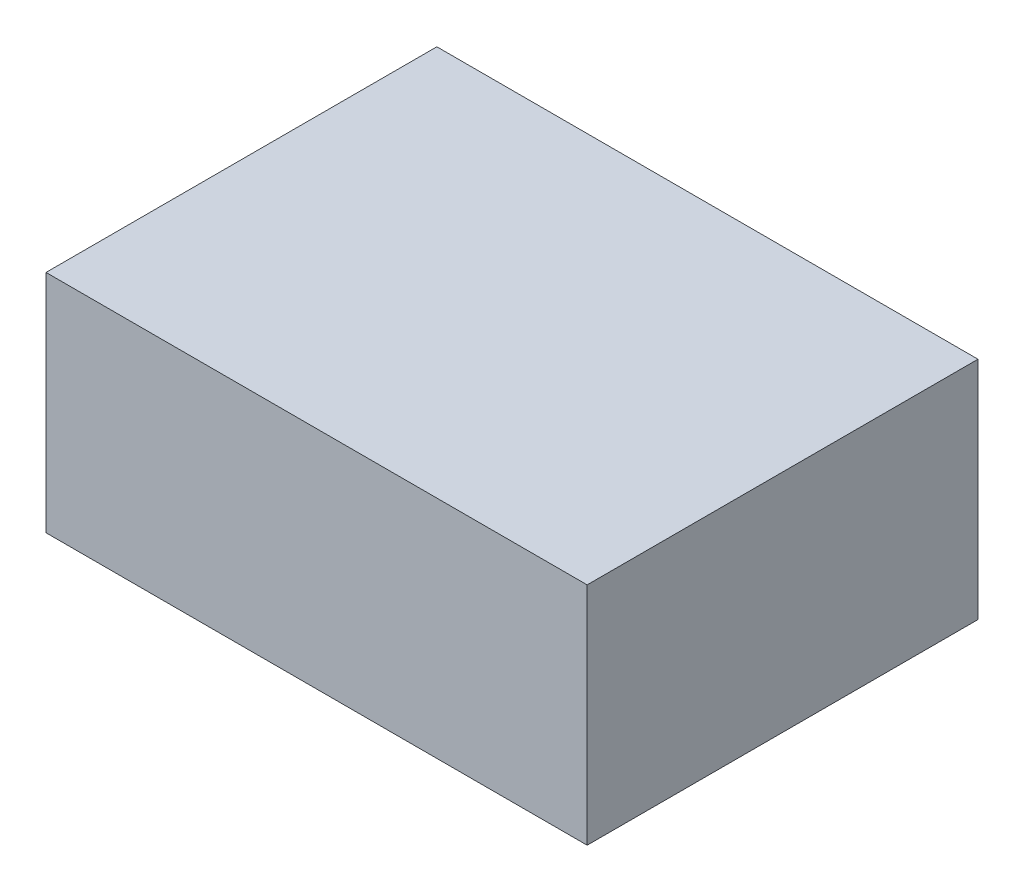
ISO-10303-21;
HEADER;
FILE_DESCRIPTION(('STEP AP214'),'2;1');
FILE_NAME('part.step','',(''),(''),'','','');
FILE_SCHEMA(('AUTOMOTIVE_DESIGN { 1 0 10303 214 1 1 1 1 }'));
ENDSEC;
DATA;
#1=APPLICATION_CONTEXT('core data for automotive mechanical design processes');
#2=APPLICATION_PROTOCOL_DEFINITION('international standard','automotive_design',2000,#1);
#3=PRODUCT_CONTEXT('',#1,'mechanical');
#4=PRODUCT('Part','Part','',(#3));
#5=PRODUCT_RELATED_PRODUCT_CATEGORY('part','',(#4));
#6=PRODUCT_DEFINITION_FORMATION('','',#4);
#7=PRODUCT_DEFINITION_CONTEXT('part definition',#1,'design');
#8=PRODUCT_DEFINITION('design','',#6,#7);
#9=PRODUCT_DEFINITION_SHAPE('','',#8);
#10=(LENGTH_UNIT() NAMED_UNIT(*) SI_UNIT(.MILLI.,.METRE.));
#11=(NAMED_UNIT(*) PLANE_ANGLE_UNIT() SI_UNIT($,.RADIAN.));
#12=(NAMED_UNIT(*) SI_UNIT($,.STERADIAN.) SOLID_ANGLE_UNIT());
#13=UNCERTAINTY_MEASURE_WITH_UNIT(LENGTH_MEASURE(1.E-05),#10,'distance_accuracy_value','');
#14=(GEOMETRIC_REPRESENTATION_CONTEXT(3) GLOBAL_UNCERTAINTY_ASSIGNED_CONTEXT((#13)) GLOBAL_UNIT_ASSIGNED_CONTEXT((#10,
#11,#12)) REPRESENTATION_CONTEXT('',''));
#15=CARTESIAN_POINT('',(0.,0.,0.));
#16=DIRECTION('',(0.,0.,1.));
#17=DIRECTION('',(1.,0.,0.));
#18=AXIS2_PLACEMENT_3D('',#15,#16,#17);
#19=CARTESIAN_POINT('',(22.86,19.05,16.51));
#20=DIRECTION('',(-1.,0.,0.));
#21=DIRECTION('',(0.,0.,1.));
#22=AXIS2_PLACEMENT_3D('',#19,#20,#21);
#23=PLANE('',#22);
#24=DIRECTION('',(0.,0.,-1.));
#25=VECTOR('',#24,1.);
#26=CARTESIAN_POINT('',(22.86,0.,16.51));
#27=LINE('',#26,#25);
#28=CARTESIAN_POINT('',(22.86,0.,16.51));
#29=VERTEX_POINT('',#28);
#30=CARTESIAN_POINT('',(22.86,0.,-16.51));
#31=VERTEX_POINT('',#30);
#32=EDGE_CURVE('E96',#29,#31,#27,.T.);
#33=ORIENTED_EDGE('',*,*,#32,.T.);
#34=DIRECTION('',(0.,-1.,0.));
#35=VECTOR('',#34,1.);
#36=CARTESIAN_POINT('',(22.86,19.05,-16.51));
#37=LINE('',#36,#35);
#38=CARTESIAN_POINT('',(22.86,19.05,-16.51));
#39=VERTEX_POINT('',#38);
#40=EDGE_CURVE('E11',#39,#31,#37,.T.);
#41=ORIENTED_EDGE('',*,*,#40,.F.);
#42=DIRECTION('',(0.,0.,-1.));
#43=VECTOR('',#42,1.);
#44=CARTESIAN_POINT('',(22.86,19.05,16.51));
#45=LINE('',#44,#43);
#46=CARTESIAN_POINT('',(22.86,19.05,16.51));
#47=VERTEX_POINT('',#46);
#48=EDGE_CURVE('E84',#47,#39,#45,.T.);
#49=ORIENTED_EDGE('',*,*,#48,.F.);
#50=DIRECTION('',(0.,-1.,0.));
#51=VECTOR('',#50,1.);
#52=CARTESIAN_POINT('',(22.86,19.05,16.51));
#53=LINE('',#52,#51);
#54=EDGE_CURVE('E92',#47,#29,#53,.T.);
#55=ORIENTED_EDGE('',*,*,#54,.T.);
#56=EDGE_LOOP('',(#33,#41,#49,#55));
#57=FACE_BOUND('',#56,.T.);
#58=ADVANCED_FACE('F33',(#57),#23,.F.);
#59=CARTESIAN_POINT('',(-22.86,19.05,-16.51));
#60=DIRECTION('',(0.,0.,1.));
#61=DIRECTION('',(1.,0.,0.));
#62=AXIS2_PLACEMENT_3D('',#59,#60,#61);
#63=PLANE('',#62);
#64=DIRECTION('',(-1.,0.,0.));
#65=VECTOR('',#64,1.);
#66=CARTESIAN_POINT('',(-22.86,0.,-16.51));
#67=LINE('',#66,#65);
#68=CARTESIAN_POINT('',(-22.86,0.,-16.51));
#69=VERTEX_POINT('',#68);
#70=EDGE_CURVE('E88',#31,#69,#67,.T.);
#71=ORIENTED_EDGE('',*,*,#70,.T.);
#72=DIRECTION('',(0.,-1.,0.));
#73=VECTOR('',#72,1.);
#74=CARTESIAN_POINT('',(-22.86,19.05,-16.51));
#75=LINE('',#74,#73);
#76=CARTESIAN_POINT('',(-22.86,19.05,-16.51));
#77=VERTEX_POINT('',#76);
#78=EDGE_CURVE('E41',#77,#69,#75,.T.);
#79=ORIENTED_EDGE('',*,*,#78,.F.);
#80=DIRECTION('',(-1.,0.,0.));
#81=VECTOR('',#80,1.);
#82=CARTESIAN_POINT('',(-22.86,19.05,-16.51));
#83=LINE('',#82,#81);
#84=EDGE_CURVE('E79',#39,#77,#83,.T.);
#85=ORIENTED_EDGE('',*,*,#84,.F.);
#86=ORIENTED_EDGE('',*,*,#40,.T.);
#87=EDGE_LOOP('',(#71,#79,#85,#86));
#88=FACE_BOUND('',#87,.T.);
#89=ADVANCED_FACE('F87',(#88),#63,.F.);
#90=CARTESIAN_POINT('',(-22.86,19.05,16.51));
#91=DIRECTION('',(1.,0.,0.));
#92=DIRECTION('',(0.,0.,-1.));
#93=AXIS2_PLACEMENT_3D('',#90,#91,#92);
#94=PLANE('',#93);
#95=DIRECTION('',(0.,0.,1.));
#96=VECTOR('',#95,1.);
#97=CARTESIAN_POINT('',(-22.86,0.,16.51));
#98=LINE('',#97,#96);
#99=CARTESIAN_POINT('',(-22.86,0.,16.51));
#100=VERTEX_POINT('',#99);
#101=EDGE_CURVE('E66',#69,#100,#98,.T.);
#102=ORIENTED_EDGE('',*,*,#101,.T.);
#103=DIRECTION('',(0.,-1.,0.));
#104=VECTOR('',#103,1.);
#105=CARTESIAN_POINT('',(-22.86,19.05,16.51));
#106=LINE('',#105,#104);
#107=CARTESIAN_POINT('',(-22.86,19.05,16.51));
#108=VERTEX_POINT('',#107);
#109=EDGE_CURVE('E89',#108,#100,#106,.T.);
#110=ORIENTED_EDGE('',*,*,#109,.F.);
#111=DIRECTION('',(0.,0.,1.));
#112=VECTOR('',#111,1.);
#113=CARTESIAN_POINT('',(-22.86,19.05,16.51));
#114=LINE('',#113,#112);
#115=EDGE_CURVE('E82',#77,#108,#114,.T.);
#116=ORIENTED_EDGE('',*,*,#115,.F.);
#117=ORIENTED_EDGE('',*,*,#78,.T.);
#118=EDGE_LOOP('',(#102,#110,#116,#117));
#119=FACE_BOUND('',#118,.T.);
#120=ADVANCED_FACE('F90',(#119),#94,.F.);
#121=CARTESIAN_POINT('',(-22.86,19.05,16.51));
#122=DIRECTION('',(0.,0.,-1.));
#123=DIRECTION('',(-1.,0.,0.));
#124=AXIS2_PLACEMENT_3D('',#121,#122,#123);
#125=PLANE('',#124);
#126=DIRECTION('',(1.,0.,0.));
#127=VECTOR('',#126,1.);
#128=CARTESIAN_POINT('',(-22.86,0.,16.51));
#129=LINE('',#128,#127);
#130=EDGE_CURVE('E72',#100,#29,#129,.T.);
#131=ORIENTED_EDGE('',*,*,#130,.T.);
#132=ORIENTED_EDGE('',*,*,#54,.F.);
#133=DIRECTION('',(1.,0.,0.));
#134=VECTOR('',#133,1.);
#135=CARTESIAN_POINT('',(-22.86,19.05,16.51));
#136=LINE('',#135,#134);
#137=EDGE_CURVE('E49',#108,#47,#136,.T.);
#138=ORIENTED_EDGE('',*,*,#137,.F.);
#139=ORIENTED_EDGE('',*,*,#109,.T.);
#140=EDGE_LOOP('',(#131,#132,#138,#139));
#141=FACE_BOUND('',#140,.T.);
#142=ADVANCED_FACE('F103',(#141),#125,.F.);
#143=CARTESIAN_POINT('',(0.,19.05,0.));
#144=DIRECTION('',(0.,-1.,0.));
#145=DIRECTION('',(0.,0.,-1.));
#146=AXIS2_PLACEMENT_3D('',#143,#144,#145);
#147=PLANE('',#146);
#148=ORIENTED_EDGE('',*,*,#48,.T.);
#149=ORIENTED_EDGE('',*,*,#84,.T.);
#150=ORIENTED_EDGE('',*,*,#115,.T.);
#151=ORIENTED_EDGE('',*,*,#137,.T.);
#152=EDGE_LOOP('',(#148,#149,#150,#151));
#153=FACE_BOUND('',#152,.T.);
#154=ADVANCED_FACE('F80',(#153),#147,.F.);
#155=CARTESIAN_POINT('',(0.,0.,0.));
#156=DIRECTION('',(0.,-1.,0.));
#157=DIRECTION('',(0.,0.,-1.));
#158=AXIS2_PLACEMENT_3D('',#155,#156,#157);
#159=PLANE('',#158);
#160=ORIENTED_EDGE('',*,*,#32,.F.);
#161=ORIENTED_EDGE('',*,*,#130,.F.);
#162=ORIENTED_EDGE('',*,*,#101,.F.);
#163=ORIENTED_EDGE('',*,*,#70,.F.);
#164=EDGE_LOOP('',(#160,#161,#162,#163));
#165=FACE_BOUND('',#164,.T.);
#166=ADVANCED_FACE('F106',(#165),#159,.T.);
#167=CLOSED_SHELL('',(#58,#89,#120,#142,#154,#166));
#168=MANIFOLD_SOLID_BREP('B2',#167);
#169=ADVANCED_BREP_SHAPE_REPRESENTATION('',(#18,#168),#14);
#170=SHAPE_DEFINITION_REPRESENTATION(#9,#169);
ENDSEC;
END-ISO-10303-21;
